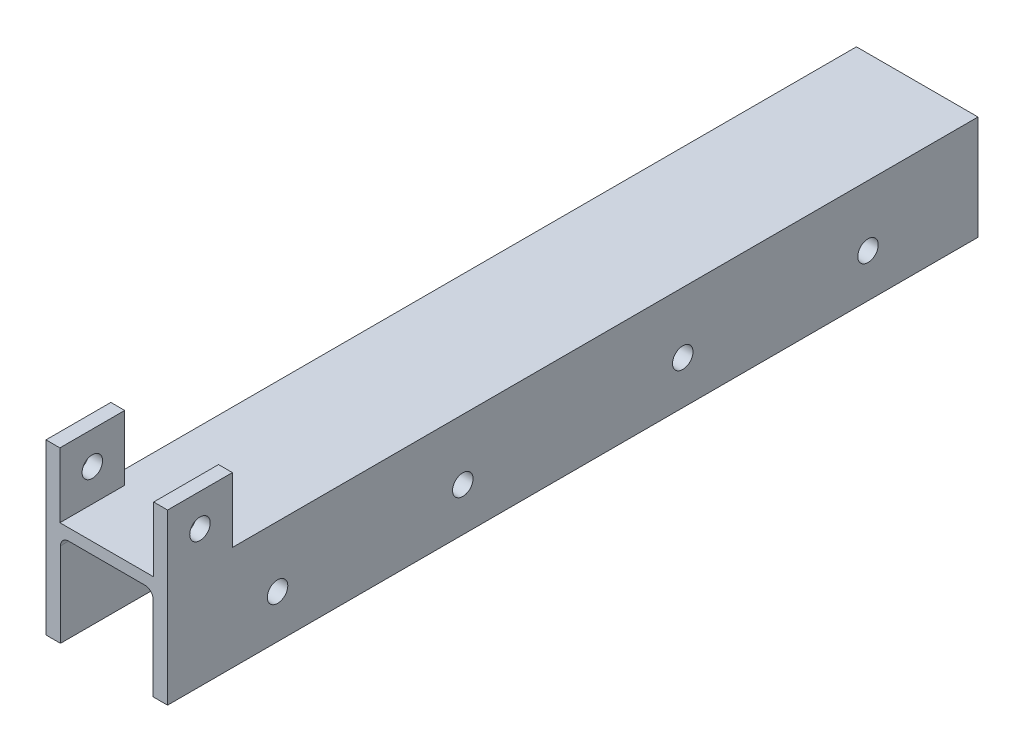
ISO-10303-21;
HEADER;
FILE_DESCRIPTION(('STEP AP214'),'2;1');
FILE_NAME('part.step','',(''),(''),'','','');
FILE_SCHEMA(('AUTOMOTIVE_DESIGN { 1 0 10303 214 1 1 1 1 }'));
ENDSEC;
DATA;
#1=APPLICATION_CONTEXT('core data for automotive mechanical design processes');
#2=APPLICATION_PROTOCOL_DEFINITION('international standard','automotive_design',2000,#1);
#3=PRODUCT_CONTEXT('',#1,'mechanical');
#4=PRODUCT('Part','Part','',(#3));
#5=PRODUCT_RELATED_PRODUCT_CATEGORY('part','',(#4));
#6=PRODUCT_DEFINITION_FORMATION('','',#4);
#7=PRODUCT_DEFINITION_CONTEXT('part definition',#1,'design');
#8=PRODUCT_DEFINITION('design','',#6,#7);
#9=PRODUCT_DEFINITION_SHAPE('','',#8);
#10=(LENGTH_UNIT() NAMED_UNIT(*) SI_UNIT(.MILLI.,.METRE.));
#11=(NAMED_UNIT(*) PLANE_ANGLE_UNIT() SI_UNIT($,.RADIAN.));
#12=(NAMED_UNIT(*) SI_UNIT($,.STERADIAN.) SOLID_ANGLE_UNIT());
#13=UNCERTAINTY_MEASURE_WITH_UNIT(LENGTH_MEASURE(1.E-05),#10,'distance_accuracy_value','');
#14=(GEOMETRIC_REPRESENTATION_CONTEXT(3) GLOBAL_UNCERTAINTY_ASSIGNED_CONTEXT((#13)) GLOBAL_UNIT_ASSIGNED_CONTEXT((#10,
#11,#12)) REPRESENTATION_CONTEXT('',''));
#15=CARTESIAN_POINT('',(0.,0.,0.));
#16=DIRECTION('',(0.,0.,1.));
#17=DIRECTION('',(1.,0.,0.));
#18=AXIS2_PLACEMENT_3D('',#15,#16,#17);
#19=CARTESIAN_POINT('',(0.,0.,-177.8));
#20=DIRECTION('',(0.,-1.,0.));
#21=DIRECTION('',(0.,0.,-1.));
#22=AXIS2_PLACEMENT_3D('',#19,#20,#21);
#23=PLANE('',#22);
#24=DIRECTION('',(1.,0.,0.));
#25=VECTOR('',#24,1.);
#26=CARTESIAN_POINT('',(0.,0.,0.));
#27=LINE('',#26,#25);
#28=CARTESIAN_POINT('',(0.,0.,0.));
#29=VERTEX_POINT('',#28);
#30=CARTESIAN_POINT('',(3.175,0.,0.));
#31=VERTEX_POINT('',#30);
#32=EDGE_CURVE('E245',#29,#31,#27,.T.);
#33=ORIENTED_EDGE('',*,*,#32,.F.);
#34=DIRECTION('',(0.,0.,1.));
#35=VECTOR('',#34,1.);
#36=CARTESIAN_POINT('',(0.,0.,-177.8));
#37=LINE('',#36,#35);
#38=CARTESIAN_POINT('',(0.,0.,-177.8));
#39=VERTEX_POINT('',#38);
#40=EDGE_CURVE('E11',#39,#29,#37,.T.);
#41=ORIENTED_EDGE('',*,*,#40,.F.);
#42=DIRECTION('',(1.,0.,0.));
#43=VECTOR('',#42,1.);
#44=CARTESIAN_POINT('',(0.,0.,-177.8));
#45=LINE('',#44,#43);
#46=CARTESIAN_POINT('',(3.175,0.,-177.8));
#47=VERTEX_POINT('',#46);
#48=EDGE_CURVE('E246',#39,#47,#45,.T.);
#49=ORIENTED_EDGE('',*,*,#48,.T.);
#50=DIRECTION('',(0.,0.,1.));
#51=VECTOR('',#50,1.);
#52=CARTESIAN_POINT('',(3.175,0.,-177.8));
#53=LINE('',#52,#51);
#54=EDGE_CURVE('E275',#47,#31,#53,.T.);
#55=ORIENTED_EDGE('',*,*,#54,.T.);
#56=EDGE_LOOP('',(#33,#41,#49,#55));
#57=FACE_BOUND('',#56,.T.);
#58=ADVANCED_FACE('F41',(#57),#23,.T.);
#59=CARTESIAN_POINT('',(0.,0.,-177.8));
#60=DIRECTION('',(-1.,0.,0.));
#61=DIRECTION('',(0.,0.,1.));
#62=AXIS2_PLACEMENT_3D('',#59,#60,#61);
#63=PLANE('',#62);
#64=CARTESIAN_POINT('',(0.,29.972,-7.112));
#65=DIRECTION('',(-1.,0.,0.));
#66=DIRECTION('',(0.,0.,1.));
#67=AXIS2_PLACEMENT_3D('',#64,#65,#66);
#68=CIRCLE('',#67,2.2479);
#69=CARTESIAN_POINT('',(0.,29.972,-4.8641));
#70=VERTEX_POINT('',#69);
#71=EDGE_CURVE('E668',#70,#70,#68,.T.);
#72=ORIENTED_EDGE('',*,*,#71,.F.);
#73=EDGE_LOOP('',(#72));
#74=FACE_BOUND('',#73,.T.);
#75=CARTESIAN_POINT('',(0.,9.525,-24.13));
#76=DIRECTION('',(1.,0.,0.));
#77=DIRECTION('',(0.,0.,-1.));
#78=AXIS2_PLACEMENT_3D('',#75,#76,#77);
#79=CIRCLE('',#78,2.2479);
#80=CARTESIAN_POINT('',(0.,9.525,-26.3779));
#81=VERTEX_POINT('',#80);
#82=EDGE_CURVE('E213',#81,#81,#79,.T.);
#83=ORIENTED_EDGE('',*,*,#82,.T.);
#84=EDGE_LOOP('',(#83));
#85=FACE_BOUND('',#84,.T.);
#86=CARTESIAN_POINT('',(0.,9.525,-64.77));
#87=DIRECTION('',(1.,0.,0.));
#88=DIRECTION('',(0.,0.,-1.));
#89=AXIS2_PLACEMENT_3D('',#86,#87,#88);
#90=CIRCLE('',#89,2.2479);
#91=CARTESIAN_POINT('',(0.,9.525,-67.0179));
#92=VERTEX_POINT('',#91);
#93=EDGE_CURVE('E216',#92,#92,#90,.T.);
#94=ORIENTED_EDGE('',*,*,#93,.T.);
#95=EDGE_LOOP('',(#94));
#96=FACE_BOUND('',#95,.T.);
#97=CARTESIAN_POINT('',(0.,9.525,-113.03));
#98=DIRECTION('',(1.,0.,0.));
#99=DIRECTION('',(0.,0.,1.));
#100=AXIS2_PLACEMENT_3D('',#97,#98,#99);
#101=CIRCLE('',#100,2.2479);
#102=CARTESIAN_POINT('',(0.,9.525,-110.7821));
#103=VERTEX_POINT('',#102);
#104=EDGE_CURVE('E222',#103,#103,#101,.T.);
#105=ORIENTED_EDGE('',*,*,#104,.T.);
#106=EDGE_LOOP('',(#105));
#107=FACE_BOUND('',#106,.T.);
#108=CARTESIAN_POINT('',(0.,9.525,-153.67));
#109=DIRECTION('',(1.,0.,0.));
#110=DIRECTION('',(0.,0.,1.));
#111=AXIS2_PLACEMENT_3D('',#108,#109,#110);
#112=CIRCLE('',#111,2.2479);
#113=CARTESIAN_POINT('',(0.,9.525,-151.4221));
#114=VERTEX_POINT('',#113);
#115=EDGE_CURVE('E179',#114,#114,#112,.T.);
#116=ORIENTED_EDGE('',*,*,#115,.T.);
#117=EDGE_LOOP('',(#116));
#118=FACE_BOUND('',#117,.T.);
#119=DIRECTION('',(0.,-1.,0.));
#120=VECTOR('',#119,1.);
#121=CARTESIAN_POINT('',(0.,0.,0.));
#122=LINE('',#121,#120);
#123=CARTESIAN_POINT('',(0.,37.084,0.));
#124=VERTEX_POINT('',#123);
#125=EDGE_CURVE('E250',#124,#29,#122,.T.);
#126=ORIENTED_EDGE('',*,*,#125,.F.);
#127=DIRECTION('',(0.,0.,1.));
#128=VECTOR('',#127,1.);
#129=CARTESIAN_POINT('',(0.,37.084,0.));
#130=LINE('',#129,#128);
#131=CARTESIAN_POINT('',(0.,37.084,-14.224));
#132=VERTEX_POINT('',#131);
#133=EDGE_CURVE('E199',#132,#124,#130,.T.);
#134=ORIENTED_EDGE('',*,*,#133,.F.);
#135=DIRECTION('',(0.,-1.,0.));
#136=VECTOR('',#135,1.);
#137=CARTESIAN_POINT('',(0.,37.084,-14.224));
#138=LINE('',#137,#136);
#139=CARTESIAN_POINT('',(0.,22.86,-14.224));
#140=VERTEX_POINT('',#139);
#141=EDGE_CURVE('E192',#132,#140,#138,.T.);
#142=ORIENTED_EDGE('',*,*,#141,.T.);
#143=DIRECTION('',(0.,0.,1.));
#144=VECTOR('',#143,1.);
#145=CARTESIAN_POINT('',(0.,22.86,-177.8));
#146=LINE('',#145,#144);
#147=CARTESIAN_POINT('',(0.,22.86,-177.8));
#148=VERTEX_POINT('',#147);
#149=EDGE_CURVE('E49',#148,#140,#146,.T.);
#150=ORIENTED_EDGE('',*,*,#149,.F.);
#151=DIRECTION('',(0.,-1.,0.));
#152=VECTOR('',#151,1.);
#153=CARTESIAN_POINT('',(0.,0.,-177.8));
#154=LINE('',#153,#152);
#155=EDGE_CURVE('E272',#148,#39,#154,.T.);
#156=ORIENTED_EDGE('',*,*,#155,.T.);
#157=ORIENTED_EDGE('',*,*,#40,.T.);
#158=EDGE_LOOP('',(#126,#134,#142,#150,#156,#157));
#159=FACE_BOUND('',#158,.T.);
#160=ADVANCED_FACE('F338',(#74,#85,#96,#107,#118,#159),#63,.T.);
#161=CARTESIAN_POINT('',(0.,22.86,-177.8));
#162=DIRECTION('',(0.,1.,0.));
#163=DIRECTION('',(0.,0.,1.));
#164=AXIS2_PLACEMENT_3D('',#161,#162,#163);
#165=PLANE('',#164);
#166=DIRECTION('',(0.,0.,1.));
#167=VECTOR('',#166,1.);
#168=CARTESIAN_POINT('',(23.622,22.86,0.));
#169=LINE('',#168,#167);
#170=CARTESIAN_POINT('',(23.622,22.86,-14.224));
#171=VERTEX_POINT('',#170);
#172=CARTESIAN_POINT('',(23.622,22.86,0.));
#173=VERTEX_POINT('',#172);
#174=EDGE_CURVE('E171',#171,#173,#169,.T.);
#175=ORIENTED_EDGE('',*,*,#174,.F.);
#176=DIRECTION('',(-1.,0.,0.));
#177=VECTOR('',#176,1.);
#178=CARTESIAN_POINT('',(26.67,22.86,-14.224));
#179=LINE('',#178,#177);
#180=CARTESIAN_POINT('',(26.67,22.86,-14.224));
#181=VERTEX_POINT('',#180);
#182=EDGE_CURVE('E63',#181,#171,#179,.T.);
#183=ORIENTED_EDGE('',*,*,#182,.F.);
#184=DIRECTION('',(0.,0.,1.));
#185=VECTOR('',#184,1.);
#186=CARTESIAN_POINT('',(26.67,22.86,-177.8));
#187=LINE('',#186,#185);
#188=CARTESIAN_POINT('',(26.67,22.86,-177.8));
#189=VERTEX_POINT('',#188);
#190=EDGE_CURVE('E175',#189,#181,#187,.T.);
#191=ORIENTED_EDGE('',*,*,#190,.F.);
#192=DIRECTION('',(-1.,0.,0.));
#193=VECTOR('',#192,1.);
#194=CARTESIAN_POINT('',(0.,22.86,-177.8));
#195=LINE('',#194,#193);
#196=EDGE_CURVE('E270',#189,#148,#195,.T.);
#197=ORIENTED_EDGE('',*,*,#196,.T.);
#198=ORIENTED_EDGE('',*,*,#149,.T.);
#199=DIRECTION('',(-1.,0.,0.));
#200=VECTOR('',#199,1.);
#201=CARTESIAN_POINT('',(0.,22.86,-14.224));
#202=LINE('',#201,#200);
#203=CARTESIAN_POINT('',(3.048,22.86,-14.224));
#204=VERTEX_POINT('',#203);
#205=EDGE_CURVE('E196',#204,#140,#202,.T.);
#206=ORIENTED_EDGE('',*,*,#205,.F.);
#207=DIRECTION('',(0.,0.,-1.));
#208=VECTOR('',#207,1.);
#209=CARTESIAN_POINT('',(3.048,22.86,0.));
#210=LINE('',#209,#208);
#211=CARTESIAN_POINT('',(3.048,22.86,0.));
#212=VERTEX_POINT('',#211);
#213=EDGE_CURVE('E198',#212,#204,#210,.T.);
#214=ORIENTED_EDGE('',*,*,#213,.F.);
#215=DIRECTION('',(-1.,0.,0.));
#216=VECTOR('',#215,1.);
#217=CARTESIAN_POINT('',(0.,22.86,0.));
#218=LINE('',#217,#216);
#219=EDGE_CURVE('E298',#173,#212,#218,.T.);
#220=ORIENTED_EDGE('',*,*,#219,.F.);
#221=EDGE_LOOP('',(#175,#183,#191,#197,#198,#206,#214,#220));
#222=FACE_BOUND('',#221,.T.);
#223=ADVANCED_FACE('F341',(#222),#165,.T.);
#224=CARTESIAN_POINT('',(26.67,0.,-177.8));
#225=DIRECTION('',(1.,0.,0.));
#226=DIRECTION('',(0.,0.,-1.));
#227=AXIS2_PLACEMENT_3D('',#224,#225,#226);
#228=PLANE('',#227);
#229=CARTESIAN_POINT('',(26.67,29.972,-7.112));
#230=DIRECTION('',(-1.,0.,0.));
#231=DIRECTION('',(0.,0.,1.));
#232=AXIS2_PLACEMENT_3D('',#229,#230,#231);
#233=CIRCLE('',#232,2.2479);
#234=CARTESIAN_POINT('',(26.67,29.972,-4.8641));
#235=VERTEX_POINT('',#234);
#236=EDGE_CURVE('E672',#235,#235,#233,.T.);
#237=ORIENTED_EDGE('',*,*,#236,.T.);
#238=EDGE_LOOP('',(#237));
#239=FACE_BOUND('',#238,.T.);
#240=CARTESIAN_POINT('',(26.67,9.525,-24.13));
#241=DIRECTION('',(1.,0.,0.));
#242=DIRECTION('',(0.,0.,-1.));
#243=AXIS2_PLACEMENT_3D('',#240,#241,#242);
#244=CIRCLE('',#243,2.2479);
#245=CARTESIAN_POINT('',(26.67,9.525,-26.3779));
#246=VERTEX_POINT('',#245);
#247=EDGE_CURVE('E209',#246,#246,#244,.T.);
#248=ORIENTED_EDGE('',*,*,#247,.F.);
#249=EDGE_LOOP('',(#248));
#250=FACE_BOUND('',#249,.T.);
#251=CARTESIAN_POINT('',(26.67,9.525,-64.77));
#252=DIRECTION('',(1.,0.,0.));
#253=DIRECTION('',(0.,0.,-1.));
#254=AXIS2_PLACEMENT_3D('',#251,#252,#253);
#255=CIRCLE('',#254,2.2479);
#256=CARTESIAN_POINT('',(26.67,9.525,-67.0179));
#257=VERTEX_POINT('',#256);
#258=EDGE_CURVE('E219',#257,#257,#255,.T.);
#259=ORIENTED_EDGE('',*,*,#258,.F.);
#260=EDGE_LOOP('',(#259));
#261=FACE_BOUND('',#260,.T.);
#262=CARTESIAN_POINT('',(26.67,9.525,-113.03));
#263=DIRECTION('',(1.,0.,0.));
#264=DIRECTION('',(0.,0.,1.));
#265=AXIS2_PLACEMENT_3D('',#262,#263,#264);
#266=CIRCLE('',#265,2.2479);
#267=CARTESIAN_POINT('',(26.67,9.525,-110.7821));
#268=VERTEX_POINT('',#267);
#269=EDGE_CURVE('E225',#268,#268,#266,.T.);
#270=ORIENTED_EDGE('',*,*,#269,.F.);
#271=EDGE_LOOP('',(#270));
#272=FACE_BOUND('',#271,.T.);
#273=CARTESIAN_POINT('',(26.67,9.525,-153.67));
#274=DIRECTION('',(1.,0.,0.));
#275=DIRECTION('',(0.,0.,1.));
#276=AXIS2_PLACEMENT_3D('',#273,#274,#275);
#277=CIRCLE('',#276,2.2479);
#278=CARTESIAN_POINT('',(26.67,9.525,-151.4221));
#279=VERTEX_POINT('',#278);
#280=EDGE_CURVE('E176',#279,#279,#277,.T.);
#281=ORIENTED_EDGE('',*,*,#280,.F.);
#282=EDGE_LOOP('',(#281));
#283=FACE_BOUND('',#282,.T.);
#284=DIRECTION('',(0.,1.,0.));
#285=VECTOR('',#284,1.);
#286=CARTESIAN_POINT('',(26.67,0.,0.));
#287=LINE('',#286,#285);
#288=CARTESIAN_POINT('',(26.67,0.,0.));
#289=VERTEX_POINT('',#288);
#290=CARTESIAN_POINT('',(26.67,37.084,0.));
#291=VERTEX_POINT('',#290);
#292=EDGE_CURVE('E296',#289,#291,#287,.T.);
#293=ORIENTED_EDGE('',*,*,#292,.F.);
#294=DIRECTION('',(0.,0.,1.));
#295=VECTOR('',#294,1.);
#296=CARTESIAN_POINT('',(26.67,0.,-177.8));
#297=LINE('',#296,#295);
#298=CARTESIAN_POINT('',(26.67,0.,-177.8));
#299=VERTEX_POINT('',#298);
#300=EDGE_CURVE('E305',#299,#289,#297,.T.);
#301=ORIENTED_EDGE('',*,*,#300,.F.);
#302=DIRECTION('',(0.,1.,0.));
#303=VECTOR('',#302,1.);
#304=CARTESIAN_POINT('',(26.67,0.,-177.8));
#305=LINE('',#304,#303);
#306=EDGE_CURVE('E268',#299,#189,#305,.T.);
#307=ORIENTED_EDGE('',*,*,#306,.T.);
#308=ORIENTED_EDGE('',*,*,#190,.T.);
#309=DIRECTION('',(0.,-1.,0.));
#310=VECTOR('',#309,1.);
#311=CARTESIAN_POINT('',(26.67,37.084,-14.224));
#312=LINE('',#311,#310);
#313=CARTESIAN_POINT('',(26.67,37.084,-14.224));
#314=VERTEX_POINT('',#313);
#315=EDGE_CURVE('E156',#314,#181,#312,.T.);
#316=ORIENTED_EDGE('',*,*,#315,.F.);
#317=DIRECTION('',(0.,0.,-1.));
#318=VECTOR('',#317,1.);
#319=CARTESIAN_POINT('',(26.67,37.084,0.));
#320=LINE('',#319,#318);
#321=EDGE_CURVE('E162',#291,#314,#320,.T.);
#322=ORIENTED_EDGE('',*,*,#321,.F.);
#323=EDGE_LOOP('',(#293,#301,#307,#308,#316,#322));
#324=FACE_BOUND('',#323,.T.);
#325=ADVANCED_FACE('F173',(#239,#250,#261,#272,#283,#324),#228,.T.);
#326=CARTESIAN_POINT('',(23.495,0.,-177.8));
#327=DIRECTION('',(0.,-1.,0.));
#328=DIRECTION('',(0.,0.,-1.));
#329=AXIS2_PLACEMENT_3D('',#326,#327,#328);
#330=PLANE('',#329);
#331=DIRECTION('',(1.,0.,0.));
#332=VECTOR('',#331,1.);
#333=CARTESIAN_POINT('',(23.495,0.,0.));
#334=LINE('',#333,#332);
#335=CARTESIAN_POINT('',(23.495,0.,0.));
#336=VERTEX_POINT('',#335);
#337=EDGE_CURVE('E293',#336,#289,#334,.T.);
#338=ORIENTED_EDGE('',*,*,#337,.F.);
#339=DIRECTION('',(0.,0.,1.));
#340=VECTOR('',#339,1.);
#341=CARTESIAN_POINT('',(23.495,0.,-177.8));
#342=LINE('',#341,#340);
#343=CARTESIAN_POINT('',(23.495,0.,-177.8));
#344=VERTEX_POINT('',#343);
#345=EDGE_CURVE('E307',#344,#336,#342,.T.);
#346=ORIENTED_EDGE('',*,*,#345,.F.);
#347=DIRECTION('',(1.,0.,0.));
#348=VECTOR('',#347,1.);
#349=CARTESIAN_POINT('',(23.495,0.,-177.8));
#350=LINE('',#349,#348);
#351=EDGE_CURVE('E265',#344,#299,#350,.T.);
#352=ORIENTED_EDGE('',*,*,#351,.T.);
#353=ORIENTED_EDGE('',*,*,#300,.T.);
#354=EDGE_LOOP('',(#338,#346,#352,#353));
#355=FACE_BOUND('',#354,.T.);
#356=ADVANCED_FACE('F393',(#355),#330,.T.);
#357=CARTESIAN_POINT('',(23.495,18.542,-177.8));
#358=DIRECTION('',(-1.,0.,0.));
#359=DIRECTION('',(0.,-1.,0.));
#360=AXIS2_PLACEMENT_3D('',#357,#358,#359);
#361=PLANE('',#360);
#362=CARTESIAN_POINT('',(23.495,9.525,-24.13));
#363=DIRECTION('',(-1.,0.,0.));
#364=DIRECTION('',(0.,-1.,0.));
#365=AXIS2_PLACEMENT_3D('',#362,#363,#364);
#366=CIRCLE('',#365,2.2479);
#367=CARTESIAN_POINT('',(23.495,7.2771,-24.13));
#368=VERTEX_POINT('',#367);
#369=EDGE_CURVE('E242',#368,#368,#366,.F.);
#370=ORIENTED_EDGE('',*,*,#369,.T.);
#371=EDGE_LOOP('',(#370));
#372=FACE_BOUND('',#371,.T.);
#373=CARTESIAN_POINT('',(23.495,9.525,-64.77));
#374=DIRECTION('',(-1.,0.,0.));
#375=DIRECTION('',(0.,-1.,0.));
#376=AXIS2_PLACEMENT_3D('',#373,#374,#375);
#377=CIRCLE('',#376,2.2479);
#378=CARTESIAN_POINT('',(23.495,7.2771,-64.77));
#379=VERTEX_POINT('',#378);
#380=EDGE_CURVE('E238',#379,#379,#377,.F.);
#381=ORIENTED_EDGE('',*,*,#380,.T.);
#382=EDGE_LOOP('',(#381));
#383=FACE_BOUND('',#382,.T.);
#384=CARTESIAN_POINT('',(23.495,9.525,-113.03));
#385=DIRECTION('',(-1.,0.,0.));
#386=DIRECTION('',(0.,-1.,0.));
#387=AXIS2_PLACEMENT_3D('',#384,#385,#386);
#388=CIRCLE('',#387,2.2479);
#389=CARTESIAN_POINT('',(23.495,7.2771,-113.03));
#390=VERTEX_POINT('',#389);
#391=EDGE_CURVE('E234',#390,#390,#388,.F.);
#392=ORIENTED_EDGE('',*,*,#391,.T.);
#393=EDGE_LOOP('',(#392));
#394=FACE_BOUND('',#393,.T.);
#395=CARTESIAN_POINT('',(23.495,9.525,-153.67));
#396=DIRECTION('',(-1.,0.,0.));
#397=DIRECTION('',(0.,-1.,0.));
#398=AXIS2_PLACEMENT_3D('',#395,#396,#397);
#399=CIRCLE('',#398,2.2479);
#400=CARTESIAN_POINT('',(23.495,7.2771,-153.67));
#401=VERTEX_POINT('',#400);
#402=EDGE_CURVE('E230',#401,#401,#399,.F.);
#403=ORIENTED_EDGE('',*,*,#402,.T.);
#404=EDGE_LOOP('',(#403));
#405=FACE_BOUND('',#404,.T.);
#406=DIRECTION('',(0.,-1.,0.));
#407=VECTOR('',#406,1.);
#408=CARTESIAN_POINT('',(23.495,18.542,0.));
#409=LINE('',#408,#407);
#410=CARTESIAN_POINT('',(23.495,18.542,0.));
#411=VERTEX_POINT('',#410);
#412=EDGE_CURVE('E290',#411,#336,#409,.T.);
#413=ORIENTED_EDGE('',*,*,#412,.F.);
#414=DIRECTION('',(0.,0.,1.));
#415=VECTOR('',#414,1.);
#416=CARTESIAN_POINT('',(23.495,18.542,-177.8));
#417=LINE('',#416,#415);
#418=CARTESIAN_POINT('',(23.495,18.542,-177.8));
#419=VERTEX_POINT('',#418);
#420=EDGE_CURVE('E309',#419,#411,#417,.T.);
#421=ORIENTED_EDGE('',*,*,#420,.F.);
#422=DIRECTION('',(0.,-1.,0.));
#423=VECTOR('',#422,1.);
#424=CARTESIAN_POINT('',(23.495,18.542,-177.8));
#425=LINE('',#424,#423);
#426=EDGE_CURVE('E262',#419,#344,#425,.T.);
#427=ORIENTED_EDGE('',*,*,#426,.T.);
#428=ORIENTED_EDGE('',*,*,#345,.T.);
#429=EDGE_LOOP('',(#413,#421,#427,#428));
#430=FACE_BOUND('',#429,.T.);
#431=ADVANCED_FACE('F389',(#372,#383,#394,#405,#430),#361,.T.);
#432=CARTESIAN_POINT('',(21.717,18.542,-177.8));
#433=DIRECTION('',(0.,0.,1.));
#434=DIRECTION('',(1.,0.,0.));
#435=AXIS2_PLACEMENT_3D('',#432,#433,#434);
#436=CYLINDRICAL_SURFACE('',#435,1.778);
#437=CARTESIAN_POINT('',(21.717,18.542,0.));
#438=DIRECTION('',(0.,0.,-1.));
#439=DIRECTION('',(1.,0.,0.));
#440=AXIS2_PLACEMENT_3D('',#437,#438,#439);
#441=CIRCLE('',#440,1.778);
#442=CARTESIAN_POINT('',(21.717,20.32,0.));
#443=VERTEX_POINT('',#442);
#444=EDGE_CURVE('E287',#443,#411,#441,.T.);
#445=ORIENTED_EDGE('',*,*,#444,.F.);
#446=DIRECTION('',(0.,0.,1.));
#447=VECTOR('',#446,1.);
#448=CARTESIAN_POINT('',(21.717,20.32,-177.8));
#449=LINE('',#448,#447);
#450=CARTESIAN_POINT('',(21.717,20.32,-177.8));
#451=VERTEX_POINT('',#450);
#452=EDGE_CURVE('E311',#451,#443,#449,.T.);
#453=ORIENTED_EDGE('',*,*,#452,.F.);
#454=CARTESIAN_POINT('',(21.717,18.542,-177.8));
#455=DIRECTION('',(0.,0.,-1.));
#456=DIRECTION('',(1.,0.,0.));
#457=AXIS2_PLACEMENT_3D('',#454,#455,#456);
#458=CIRCLE('',#457,1.778);
#459=EDGE_CURVE('E259',#451,#419,#458,.T.);
#460=ORIENTED_EDGE('',*,*,#459,.T.);
#461=ORIENTED_EDGE('',*,*,#420,.T.);
#462=EDGE_LOOP('',(#445,#453,#460,#461));
#463=FACE_BOUND('',#462,.T.);
#464=ADVANCED_FACE('F385',(#463),#436,.F.);
#465=CARTESIAN_POINT('',(4.95300000000001,20.32,-177.8));
#466=DIRECTION('',(0.,-1.,0.));
#467=DIRECTION('',(0.,0.,-1.));
#468=AXIS2_PLACEMENT_3D('',#465,#466,#467);
#469=PLANE('',#468);
#470=DIRECTION('',(1.,0.,0.));
#471=VECTOR('',#470,1.);
#472=CARTESIAN_POINT('',(4.95300000000001,20.32,0.));
#473=LINE('',#472,#471);
#474=CARTESIAN_POINT('',(4.95300000000001,20.32,0.));
#475=VERTEX_POINT('',#474);
#476=EDGE_CURVE('E284',#475,#443,#473,.T.);
#477=ORIENTED_EDGE('',*,*,#476,.F.);
#478=DIRECTION('',(0.,0.,1.));
#479=VECTOR('',#478,1.);
#480=CARTESIAN_POINT('',(4.95300000000001,20.32,-177.8));
#481=LINE('',#480,#479);
#482=CARTESIAN_POINT('',(4.95300000000001,20.32,-177.8));
#483=VERTEX_POINT('',#482);
#484=EDGE_CURVE('E313',#483,#475,#481,.T.);
#485=ORIENTED_EDGE('',*,*,#484,.F.);
#486=DIRECTION('',(1.,0.,0.));
#487=VECTOR('',#486,1.);
#488=CARTESIAN_POINT('',(4.95300000000001,20.32,-177.8));
#489=LINE('',#488,#487);
#490=EDGE_CURVE('E256',#483,#451,#489,.T.);
#491=ORIENTED_EDGE('',*,*,#490,.T.);
#492=ORIENTED_EDGE('',*,*,#452,.T.);
#493=EDGE_LOOP('',(#477,#485,#491,#492));
#494=FACE_BOUND('',#493,.T.);
#495=ADVANCED_FACE('F381',(#494),#469,.T.);
#496=CARTESIAN_POINT('',(4.953,18.542,-177.8));
#497=DIRECTION('',(0.,0.,1.));
#498=DIRECTION('',(1.,0.,0.));
#499=AXIS2_PLACEMENT_3D('',#496,#497,#498);
#500=CYLINDRICAL_SURFACE('',#499,1.778);
#501=CARTESIAN_POINT('',(4.953,18.542,0.));
#502=DIRECTION('',(0.,0.,-1.));
#503=DIRECTION('',(-1.,0.,0.));
#504=AXIS2_PLACEMENT_3D('',#501,#502,#503);
#505=CIRCLE('',#504,1.778);
#506=CARTESIAN_POINT('',(3.175,18.542,0.));
#507=VERTEX_POINT('',#506);
#508=EDGE_CURVE('E281',#507,#475,#505,.T.);
#509=ORIENTED_EDGE('',*,*,#508,.F.);
#510=DIRECTION('',(0.,0.,1.));
#511=VECTOR('',#510,1.);
#512=CARTESIAN_POINT('',(3.175,18.542,-177.8));
#513=LINE('',#512,#511);
#514=CARTESIAN_POINT('',(3.175,18.542,-177.8));
#515=VERTEX_POINT('',#514);
#516=EDGE_CURVE('E315',#515,#507,#513,.T.);
#517=ORIENTED_EDGE('',*,*,#516,.F.);
#518=CARTESIAN_POINT('',(4.953,18.542,-177.8));
#519=DIRECTION('',(0.,0.,-1.));
#520=DIRECTION('',(-1.,0.,0.));
#521=AXIS2_PLACEMENT_3D('',#518,#519,#520);
#522=CIRCLE('',#521,1.778);
#523=EDGE_CURVE('E253',#515,#483,#522,.T.);
#524=ORIENTED_EDGE('',*,*,#523,.T.);
#525=ORIENTED_EDGE('',*,*,#484,.T.);
#526=EDGE_LOOP('',(#509,#517,#524,#525));
#527=FACE_BOUND('',#526,.T.);
#528=ADVANCED_FACE('F377',(#527),#500,.F.);
#529=CARTESIAN_POINT('',(3.175,0.,-177.8));
#530=DIRECTION('',(1.,0.,0.));
#531=DIRECTION('',(0.,0.,-1.));
#532=AXIS2_PLACEMENT_3D('',#529,#530,#531);
#533=PLANE('',#532);
#534=CARTESIAN_POINT('',(3.175,9.525,-24.13));
#535=DIRECTION('',(1.,0.,0.));
#536=DIRECTION('',(0.,0.,-1.));
#537=AXIS2_PLACEMENT_3D('',#534,#535,#536);
#538=CIRCLE('',#537,2.2479);
#539=CARTESIAN_POINT('',(3.175,9.525,-26.3779));
#540=VERTEX_POINT('',#539);
#541=EDGE_CURVE('E241',#540,#540,#538,.F.);
#542=ORIENTED_EDGE('',*,*,#541,.T.);
#543=EDGE_LOOP('',(#542));
#544=FACE_BOUND('',#543,.T.);
#545=CARTESIAN_POINT('',(3.175,9.525,-64.77));
#546=DIRECTION('',(1.,0.,0.));
#547=DIRECTION('',(0.,0.,-1.));
#548=AXIS2_PLACEMENT_3D('',#545,#546,#547);
#549=CIRCLE('',#548,2.2479);
#550=CARTESIAN_POINT('',(3.175,9.525,-67.0179));
#551=VERTEX_POINT('',#550);
#552=EDGE_CURVE('E237',#551,#551,#549,.F.);
#553=ORIENTED_EDGE('',*,*,#552,.T.);
#554=EDGE_LOOP('',(#553));
#555=FACE_BOUND('',#554,.T.);
#556=CARTESIAN_POINT('',(3.175,9.525,-113.03));
#557=DIRECTION('',(1.,0.,0.));
#558=DIRECTION('',(0.,0.,-1.));
#559=AXIS2_PLACEMENT_3D('',#556,#557,#558);
#560=CIRCLE('',#559,2.2479);
#561=CARTESIAN_POINT('',(3.175,9.525,-115.2779));
#562=VERTEX_POINT('',#561);
#563=EDGE_CURVE('E233',#562,#562,#560,.F.);
#564=ORIENTED_EDGE('',*,*,#563,.T.);
#565=EDGE_LOOP('',(#564));
#566=FACE_BOUND('',#565,.T.);
#567=CARTESIAN_POINT('',(3.175,9.525,-153.67));
#568=DIRECTION('',(1.,0.,0.));
#569=DIRECTION('',(0.,0.,-1.));
#570=AXIS2_PLACEMENT_3D('',#567,#568,#569);
#571=CIRCLE('',#570,2.2479);
#572=CARTESIAN_POINT('',(3.175,9.525,-155.9179));
#573=VERTEX_POINT('',#572);
#574=EDGE_CURVE('E212',#573,#573,#571,.F.);
#575=ORIENTED_EDGE('',*,*,#574,.T.);
#576=EDGE_LOOP('',(#575));
#577=FACE_BOUND('',#576,.T.);
#578=DIRECTION('',(0.,1.,0.));
#579=VECTOR('',#578,1.);
#580=CARTESIAN_POINT('',(3.175,0.,0.));
#581=LINE('',#580,#579);
#582=EDGE_CURVE('E278',#31,#507,#581,.T.);
#583=ORIENTED_EDGE('',*,*,#582,.F.);
#584=ORIENTED_EDGE('',*,*,#54,.F.);
#585=DIRECTION('',(0.,1.,0.));
#586=VECTOR('',#585,1.);
#587=CARTESIAN_POINT('',(3.175,0.,-177.8));
#588=LINE('',#587,#586);
#589=EDGE_CURVE('E249',#47,#515,#588,.T.);
#590=ORIENTED_EDGE('',*,*,#589,.T.);
#591=ORIENTED_EDGE('',*,*,#516,.T.);
#592=EDGE_LOOP('',(#583,#584,#590,#591));
#593=FACE_BOUND('',#592,.T.);
#594=ADVANCED_FACE('F326',(#544,#555,#566,#577,#593),#533,.T.);
#595=CARTESIAN_POINT('',(4.953,18.542,-177.8));
#596=DIRECTION('',(0.,0.,-1.));
#597=DIRECTION('',(-1.,0.,0.));
#598=AXIS2_PLACEMENT_3D('',#595,#596,#597);
#599=PLANE('',#598);
#600=ORIENTED_EDGE('',*,*,#48,.F.);
#601=ORIENTED_EDGE('',*,*,#155,.F.);
#602=ORIENTED_EDGE('',*,*,#196,.F.);
#603=ORIENTED_EDGE('',*,*,#306,.F.);
#604=ORIENTED_EDGE('',*,*,#351,.F.);
#605=ORIENTED_EDGE('',*,*,#426,.F.);
#606=ORIENTED_EDGE('',*,*,#459,.F.);
#607=ORIENTED_EDGE('',*,*,#490,.F.);
#608=ORIENTED_EDGE('',*,*,#523,.F.);
#609=ORIENTED_EDGE('',*,*,#589,.F.);
#610=EDGE_LOOP('',(#600,#601,#602,#603,#604,#605,#606,#607,#608,#609));
#611=FACE_BOUND('',#610,.T.);
#612=ADVANCED_FACE('F369',(#611),#599,.T.);
#613=CARTESIAN_POINT('',(4.953,18.542,0.));
#614=DIRECTION('',(0.,0.,-1.));
#615=DIRECTION('',(-1.,0.,0.));
#616=AXIS2_PLACEMENT_3D('',#613,#614,#615);
#617=PLANE('',#616);
#618=ORIENTED_EDGE('',*,*,#32,.T.);
#619=ORIENTED_EDGE('',*,*,#582,.T.);
#620=ORIENTED_EDGE('',*,*,#508,.T.);
#621=ORIENTED_EDGE('',*,*,#476,.T.);
#622=ORIENTED_EDGE('',*,*,#444,.T.);
#623=ORIENTED_EDGE('',*,*,#412,.T.);
#624=ORIENTED_EDGE('',*,*,#337,.T.);
#625=ORIENTED_EDGE('',*,*,#292,.T.);
#626=DIRECTION('',(1.,0.,0.));
#627=VECTOR('',#626,1.);
#628=CARTESIAN_POINT('',(26.67,37.084,0.));
#629=LINE('',#628,#627);
#630=CARTESIAN_POINT('',(23.622,37.084,0.));
#631=VERTEX_POINT('',#630);
#632=EDGE_CURVE('E168',#631,#291,#629,.T.);
#633=ORIENTED_EDGE('',*,*,#632,.F.);
#634=DIRECTION('',(0.,-1.,0.));
#635=VECTOR('',#634,1.);
#636=CARTESIAN_POINT('',(23.622,37.084,0.));
#637=LINE('',#636,#635);
#638=EDGE_CURVE('E181',#631,#173,#637,.T.);
#639=ORIENTED_EDGE('',*,*,#638,.T.);
#640=ORIENTED_EDGE('',*,*,#219,.T.);
#641=DIRECTION('',(0.,-1.,0.));
#642=VECTOR('',#641,1.);
#643=CARTESIAN_POINT('',(3.048,37.084,0.));
#644=LINE('',#643,#642);
#645=CARTESIAN_POINT('',(3.048,37.084,0.));
#646=VERTEX_POINT('',#645);
#647=EDGE_CURVE('E185',#646,#212,#644,.T.);
#648=ORIENTED_EDGE('',*,*,#647,.F.);
#649=DIRECTION('',(1.,0.,0.));
#650=VECTOR('',#649,1.);
#651=CARTESIAN_POINT('',(0.,37.084,0.));
#652=LINE('',#651,#650);
#653=EDGE_CURVE('E205',#124,#646,#652,.T.);
#654=ORIENTED_EDGE('',*,*,#653,.F.);
#655=ORIENTED_EDGE('',*,*,#125,.T.);
#656=EDGE_LOOP('',(#618,#619,#620,#621,#622,#623,#624,#625,#633,#639,#640,#648,#654,#655));
#657=FACE_BOUND('',#656,.T.);
#658=ADVANCED_FACE('F355',(#657),#617,.F.);
#659=CARTESIAN_POINT('',(26.67,9.525,-153.67));
#660=DIRECTION('',(-1.,0.,0.));
#661=DIRECTION('',(0.,0.,1.));
#662=AXIS2_PLACEMENT_3D('',#659,#660,#661);
#663=CYLINDRICAL_SURFACE('',#662,2.2479);
#664=ORIENTED_EDGE('',*,*,#574,.F.);
#665=EDGE_LOOP('',(#664));
#666=FACE_BOUND('',#665,.T.);
#667=ORIENTED_EDGE('',*,*,#115,.F.);
#668=EDGE_LOOP('',(#667));
#669=FACE_BOUND('',#668,.T.);
#670=ADVANCED_FACE('F484',(#666,#669),#663,.F.);
#671=CARTESIAN_POINT('',(26.67,9.525,-113.03));
#672=DIRECTION('',(-1.,0.,0.));
#673=DIRECTION('',(0.,0.,1.));
#674=AXIS2_PLACEMENT_3D('',#671,#672,#673);
#675=CYLINDRICAL_SURFACE('',#674,2.2479);
#676=ORIENTED_EDGE('',*,*,#563,.F.);
#677=EDGE_LOOP('',(#676));
#678=FACE_BOUND('',#677,.T.);
#679=ORIENTED_EDGE('',*,*,#104,.F.);
#680=EDGE_LOOP('',(#679));
#681=FACE_BOUND('',#680,.T.);
#682=ADVANCED_FACE('F488',(#678,#681),#675,.F.);
#683=CARTESIAN_POINT('',(26.67,9.525,-64.77));
#684=DIRECTION('',(-1.,0.,0.));
#685=DIRECTION('',(0.,0.,1.));
#686=AXIS2_PLACEMENT_3D('',#683,#684,#685);
#687=CYLINDRICAL_SURFACE('',#686,2.2479);
#688=ORIENTED_EDGE('',*,*,#552,.F.);
#689=EDGE_LOOP('',(#688));
#690=FACE_BOUND('',#689,.T.);
#691=ORIENTED_EDGE('',*,*,#93,.F.);
#692=EDGE_LOOP('',(#691));
#693=FACE_BOUND('',#692,.T.);
#694=ADVANCED_FACE('F333',(#690,#693),#687,.F.);
#695=CARTESIAN_POINT('',(26.67,9.525,-24.13));
#696=DIRECTION('',(-1.,0.,0.));
#697=DIRECTION('',(0.,0.,1.));
#698=AXIS2_PLACEMENT_3D('',#695,#696,#697);
#699=CYLINDRICAL_SURFACE('',#698,2.2479);
#700=ORIENTED_EDGE('',*,*,#541,.F.);
#701=EDGE_LOOP('',(#700));
#702=FACE_BOUND('',#701,.T.);
#703=ORIENTED_EDGE('',*,*,#82,.F.);
#704=EDGE_LOOP('',(#703));
#705=FACE_BOUND('',#704,.T.);
#706=ADVANCED_FACE('F329',(#702,#705),#699,.F.);
#707=ORIENTED_EDGE('',*,*,#402,.F.);
#708=EDGE_LOOP('',(#707));
#709=FACE_BOUND('',#708,.T.);
#710=ORIENTED_EDGE('',*,*,#280,.T.);
#711=EDGE_LOOP('',(#710));
#712=FACE_BOUND('',#711,.T.);
#713=ADVANCED_FACE('F332',(#709,#712),#663,.F.);
#714=ORIENTED_EDGE('',*,*,#391,.F.);
#715=EDGE_LOOP('',(#714));
#716=FACE_BOUND('',#715,.T.);
#717=ORIENTED_EDGE('',*,*,#269,.T.);
#718=EDGE_LOOP('',(#717));
#719=FACE_BOUND('',#718,.T.);
#720=ADVANCED_FACE('F499',(#716,#719),#675,.F.);
#721=ORIENTED_EDGE('',*,*,#380,.F.);
#722=EDGE_LOOP('',(#721));
#723=FACE_BOUND('',#722,.T.);
#724=ORIENTED_EDGE('',*,*,#258,.T.);
#725=EDGE_LOOP('',(#724));
#726=FACE_BOUND('',#725,.T.);
#727=ADVANCED_FACE('F415',(#723,#726),#687,.F.);
#728=ORIENTED_EDGE('',*,*,#369,.F.);
#729=EDGE_LOOP('',(#728));
#730=FACE_BOUND('',#729,.T.);
#731=ORIENTED_EDGE('',*,*,#247,.T.);
#732=EDGE_LOOP('',(#731));
#733=FACE_BOUND('',#732,.T.);
#734=ADVANCED_FACE('F335',(#730,#733),#699,.F.);
#735=CARTESIAN_POINT('',(3.048,37.084,0.));
#736=DIRECTION('',(-1.,0.,0.));
#737=DIRECTION('',(0.,0.,1.));
#738=AXIS2_PLACEMENT_3D('',#735,#736,#737);
#739=PLANE('',#738);
#740=CARTESIAN_POINT('',(3.048,29.972,-7.112));
#741=DIRECTION('',(-1.,0.,0.));
#742=DIRECTION('',(0.,0.,1.));
#743=AXIS2_PLACEMENT_3D('',#740,#741,#742);
#744=CIRCLE('',#743,2.2479);
#745=CARTESIAN_POINT('',(3.048,29.972,-4.8641));
#746=VERTEX_POINT('',#745);
#747=EDGE_CURVE('E189',#746,#746,#744,.T.);
#748=ORIENTED_EDGE('',*,*,#747,.T.);
#749=EDGE_LOOP('',(#748));
#750=FACE_BOUND('',#749,.T.);
#751=ORIENTED_EDGE('',*,*,#213,.T.);
#752=DIRECTION('',(0.,-1.,0.));
#753=VECTOR('',#752,1.);
#754=CARTESIAN_POINT('',(3.048,37.084,-14.224));
#755=LINE('',#754,#753);
#756=CARTESIAN_POINT('',(3.048,37.084,-14.224));
#757=VERTEX_POINT('',#756);
#758=EDGE_CURVE('E188',#757,#204,#755,.T.);
#759=ORIENTED_EDGE('',*,*,#758,.F.);
#760=DIRECTION('',(0.,0.,-1.));
#761=VECTOR('',#760,1.);
#762=CARTESIAN_POINT('',(3.048,37.084,0.));
#763=LINE('',#762,#761);
#764=EDGE_CURVE('E203',#646,#757,#763,.T.);
#765=ORIENTED_EDGE('',*,*,#764,.F.);
#766=ORIENTED_EDGE('',*,*,#647,.T.);
#767=EDGE_LOOP('',(#751,#759,#765,#766));
#768=FACE_BOUND('',#767,.T.);
#769=ADVANCED_FACE('F404',(#750,#768),#739,.F.);
#770=CARTESIAN_POINT('',(0.,37.084,-14.224));
#771=DIRECTION('',(0.,0.,1.));
#772=DIRECTION('',(1.,0.,0.));
#773=AXIS2_PLACEMENT_3D('',#770,#771,#772);
#774=PLANE('',#773);
#775=ORIENTED_EDGE('',*,*,#205,.T.);
#776=ORIENTED_EDGE('',*,*,#141,.F.);
#777=DIRECTION('',(-1.,0.,0.));
#778=VECTOR('',#777,1.);
#779=CARTESIAN_POINT('',(0.,37.084,-14.224));
#780=LINE('',#779,#778);
#781=EDGE_CURVE('E195',#757,#132,#780,.T.);
#782=ORIENTED_EDGE('',*,*,#781,.F.);
#783=ORIENTED_EDGE('',*,*,#758,.T.);
#784=EDGE_LOOP('',(#775,#776,#782,#783));
#785=FACE_BOUND('',#784,.T.);
#786=ADVANCED_FACE('F363',(#785),#774,.F.);
#787=CARTESIAN_POINT('',(0.,37.084,0.));
#788=DIRECTION('',(0.,-1.,0.));
#789=DIRECTION('',(0.,0.,-1.));
#790=AXIS2_PLACEMENT_3D('',#787,#788,#789);
#791=PLANE('',#790);
#792=ORIENTED_EDGE('',*,*,#133,.T.);
#793=ORIENTED_EDGE('',*,*,#653,.T.);
#794=ORIENTED_EDGE('',*,*,#764,.T.);
#795=ORIENTED_EDGE('',*,*,#781,.T.);
#796=EDGE_LOOP('',(#792,#793,#794,#795));
#797=FACE_BOUND('',#796,.T.);
#798=ADVANCED_FACE('F358',(#797),#791,.F.);
#799=CARTESIAN_POINT('',(26.67,37.084,-14.224));
#800=DIRECTION('',(0.,0.,1.));
#801=DIRECTION('',(1.,0.,0.));
#802=AXIS2_PLACEMENT_3D('',#799,#800,#801);
#803=PLANE('',#802);
#804=ORIENTED_EDGE('',*,*,#182,.T.);
#805=DIRECTION('',(0.,-1.,0.));
#806=VECTOR('',#805,1.);
#807=CARTESIAN_POINT('',(23.622,37.084,-14.224));
#808=LINE('',#807,#806);
#809=CARTESIAN_POINT('',(23.622,37.084,-14.224));
#810=VERTEX_POINT('',#809);
#811=EDGE_CURVE('E158',#810,#171,#808,.T.);
#812=ORIENTED_EDGE('',*,*,#811,.F.);
#813=DIRECTION('',(-1.,0.,0.));
#814=VECTOR('',#813,1.);
#815=CARTESIAN_POINT('',(26.67,37.084,-14.224));
#816=LINE('',#815,#814);
#817=EDGE_CURVE('E152',#314,#810,#816,.T.);
#818=ORIENTED_EDGE('',*,*,#817,.F.);
#819=ORIENTED_EDGE('',*,*,#315,.T.);
#820=EDGE_LOOP('',(#804,#812,#818,#819));
#821=FACE_BOUND('',#820,.T.);
#822=ADVANCED_FACE('F154',(#821),#803,.F.);
#823=CARTESIAN_POINT('',(23.622,37.084,0.));
#824=DIRECTION('',(1.,0.,0.));
#825=DIRECTION('',(0.,0.,-1.));
#826=AXIS2_PLACEMENT_3D('',#823,#824,#825);
#827=PLANE('',#826);
#828=CARTESIAN_POINT('',(23.622,29.972,-7.112));
#829=DIRECTION('',(1.,0.,0.));
#830=DIRECTION('',(0.,0.,-1.));
#831=AXIS2_PLACEMENT_3D('',#828,#829,#830);
#832=CIRCLE('',#831,2.2479);
#833=CARTESIAN_POINT('',(23.622,29.972,-9.3599));
#834=VERTEX_POINT('',#833);
#835=EDGE_CURVE('E44',#834,#834,#832,.T.);
#836=ORIENTED_EDGE('',*,*,#835,.T.);
#837=EDGE_LOOP('',(#836));
#838=FACE_BOUND('',#837,.T.);
#839=ORIENTED_EDGE('',*,*,#174,.T.);
#840=ORIENTED_EDGE('',*,*,#638,.F.);
#841=DIRECTION('',(0.,0.,1.));
#842=VECTOR('',#841,1.);
#843=CARTESIAN_POINT('',(23.622,37.084,0.));
#844=LINE('',#843,#842);
#845=EDGE_CURVE('E161',#810,#631,#844,.T.);
#846=ORIENTED_EDGE('',*,*,#845,.F.);
#847=ORIENTED_EDGE('',*,*,#811,.T.);
#848=EDGE_LOOP('',(#839,#840,#846,#847));
#849=FACE_BOUND('',#848,.T.);
#850=ADVANCED_FACE('F402',(#838,#849),#827,.F.);
#851=CARTESIAN_POINT('',(0.,37.084,0.));
#852=DIRECTION('',(0.,1.,0.));
#853=DIRECTION('',(0.,0.,1.));
#854=AXIS2_PLACEMENT_3D('',#851,#852,#853);
#855=PLANE('',#854);
#856=ORIENTED_EDGE('',*,*,#321,.T.);
#857=ORIENTED_EDGE('',*,*,#817,.T.);
#858=ORIENTED_EDGE('',*,*,#845,.T.);
#859=ORIENTED_EDGE('',*,*,#632,.T.);
#860=EDGE_LOOP('',(#856,#857,#858,#859));
#861=FACE_BOUND('',#860,.T.);
#862=ADVANCED_FACE('F166',(#861),#855,.T.);
#863=CARTESIAN_POINT('',(26.67,29.972,-7.112));
#864=DIRECTION('',(-1.,0.,0.));
#865=DIRECTION('',(0.,0.,1.));
#866=AXIS2_PLACEMENT_3D('',#863,#864,#865);
#867=CYLINDRICAL_SURFACE('',#866,2.2479);
#868=ORIENTED_EDGE('',*,*,#236,.F.);
#869=EDGE_LOOP('',(#868));
#870=FACE_BOUND('',#869,.T.);
#871=ORIENTED_EDGE('',*,*,#835,.F.);
#872=EDGE_LOOP('',(#871));
#873=FACE_BOUND('',#872,.T.);
#874=ADVANCED_FACE('F583',(#870,#873),#867,.F.);
#875=ORIENTED_EDGE('',*,*,#71,.T.);
#876=EDGE_LOOP('',(#875));
#877=FACE_BOUND('',#876,.T.);
#878=ORIENTED_EDGE('',*,*,#747,.F.);
#879=EDGE_LOOP('',(#878));
#880=FACE_BOUND('',#879,.T.);
#881=ADVANCED_FACE('F651',(#877,#880),#867,.F.);
#882=CLOSED_SHELL('',(#58,#160,#223,#325,#356,#431,#464,#495,#528,#594,#612,#658,#670,#682,#694,
#706,#713,#720,#727,#734,#769,#786,#798,#822,#850,#862,#874,#881));
#883=MANIFOLD_SOLID_BREP('B2',#882);
#884=ADVANCED_BREP_SHAPE_REPRESENTATION('',(#18,#883),#14);
#885=SHAPE_DEFINITION_REPRESENTATION(#9,#884);
ENDSEC;
END-ISO-10303-21;
